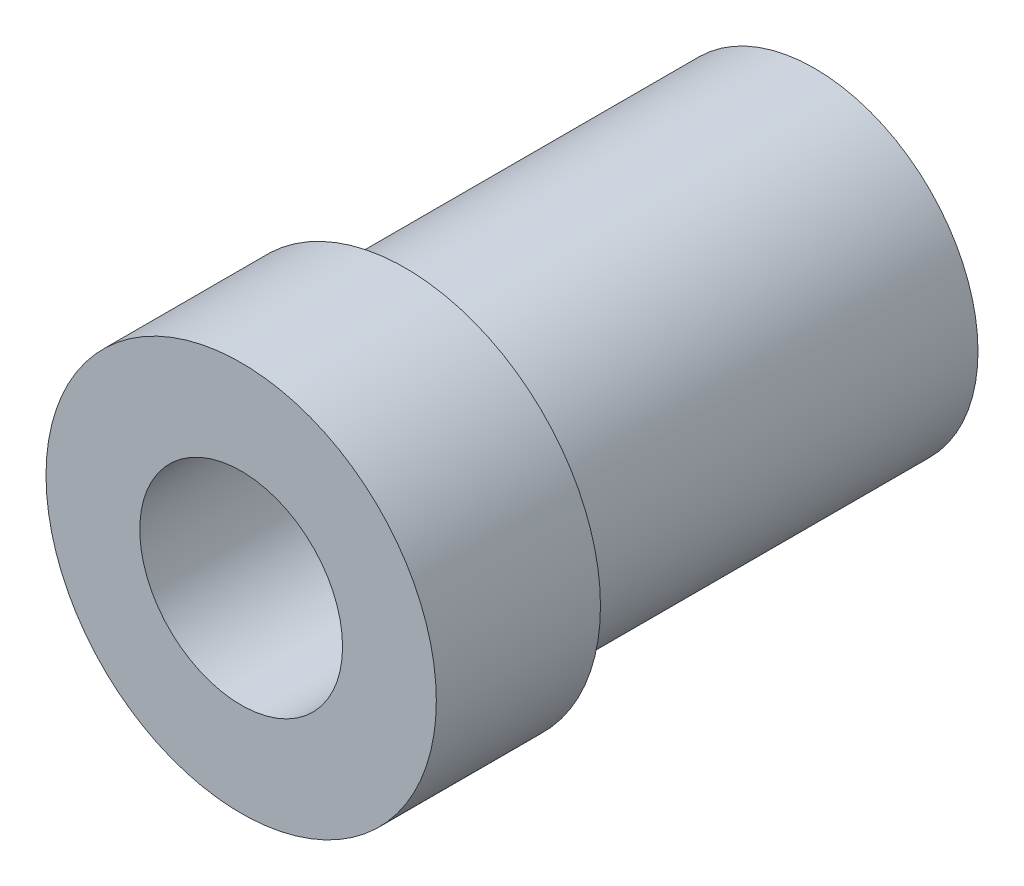
ISO-10303-21;
HEADER;
FILE_DESCRIPTION(('STEP AP214'),'2;1');
FILE_NAME('part.step','',(''),(''),'','','');
FILE_SCHEMA(('AUTOMOTIVE_DESIGN { 1 0 10303 214 1 1 1 1 }'));
ENDSEC;
DATA;
#1=APPLICATION_CONTEXT('core data for automotive mechanical design processes');
#2=APPLICATION_PROTOCOL_DEFINITION('international standard','automotive_design',2000,#1);
#3=PRODUCT_CONTEXT('',#1,'mechanical');
#4=PRODUCT('Part','Part','',(#3));
#5=PRODUCT_RELATED_PRODUCT_CATEGORY('part','',(#4));
#6=PRODUCT_DEFINITION_FORMATION('','',#4);
#7=PRODUCT_DEFINITION_CONTEXT('part definition',#1,'design');
#8=PRODUCT_DEFINITION('design','',#6,#7);
#9=PRODUCT_DEFINITION_SHAPE('','',#8);
#10=(LENGTH_UNIT() NAMED_UNIT(*) SI_UNIT(.MILLI.,.METRE.));
#11=(NAMED_UNIT(*) PLANE_ANGLE_UNIT() SI_UNIT($,.RADIAN.));
#12=(NAMED_UNIT(*) SI_UNIT($,.STERADIAN.) SOLID_ANGLE_UNIT());
#13=UNCERTAINTY_MEASURE_WITH_UNIT(LENGTH_MEASURE(1.E-05),#10,'distance_accuracy_value','');
#14=(GEOMETRIC_REPRESENTATION_CONTEXT(3) GLOBAL_UNCERTAINTY_ASSIGNED_CONTEXT((#13)) GLOBAL_UNIT_ASSIGNED_CONTEXT((#10,
#11,#12)) REPRESENTATION_CONTEXT('',''));
#15=CARTESIAN_POINT('',(0.,0.,0.));
#16=DIRECTION('',(0.,0.,1.));
#17=DIRECTION('',(1.,0.,0.));
#18=AXIS2_PLACEMENT_3D('',#15,#16,#17);
#19=CARTESIAN_POINT('',(0.,0.,0.));
#20=DIRECTION('',(0.,0.,1.));
#21=DIRECTION('',(1.,0.,0.));
#22=AXIS2_PLACEMENT_3D('',#19,#20,#21);
#23=CYLINDRICAL_SURFACE('',#22,3.9997013027737);
#24=CARTESIAN_POINT('',(0.,0.,-0.0100805876105566));
#25=DIRECTION('',(0.,0.,1.));
#26=DIRECTION('',(1.,0.,0.));
#27=AXIS2_PLACEMENT_3D('',#24,#25,#26);
#28=CIRCLE('',#27,3.9997013027737);
#29=CARTESIAN_POINT('',(3.9997013027737,0.,-0.0100805876105566));
#30=VERTEX_POINT('',#29);
#31=EDGE_CURVE('E52',#30,#30,#28,.T.);
#32=ORIENTED_EDGE('',*,*,#31,.F.);
#33=EDGE_LOOP('',(#32));
#34=FACE_BOUND('',#33,.T.);
#35=CARTESIAN_POINT('',(0.,0.,-10.0255943262682));
#36=DIRECTION('',(0.,0.,1.));
#37=DIRECTION('',(1.,0.,0.));
#38=AXIS2_PLACEMENT_3D('',#35,#36,#37);
#39=CIRCLE('',#38,3.9997013027737);
#40=CARTESIAN_POINT('',(3.9997013027737,0.,-10.0255943262682));
#41=VERTEX_POINT('',#40);
#42=EDGE_CURVE('E10',#41,#41,#39,.T.);
#43=ORIENTED_EDGE('',*,*,#42,.T.);
#44=EDGE_LOOP('',(#43));
#45=FACE_BOUND('',#44,.T.);
#46=ADVANCED_FACE('F30',(#34,#45),#23,.T.);
#47=CARTESIAN_POINT('',(0.,2.48145181579259,-10.0255943262682));
#48=DIRECTION('',(0.,0.,1.));
#49=DIRECTION('',(1.,0.,0.));
#50=AXIS2_PLACEMENT_3D('',#47,#48,#49);
#51=PLANE('',#50);
#52=ORIENTED_EDGE('',*,*,#42,.F.);
#53=EDGE_LOOP('',(#52));
#54=FACE_BOUND('',#53,.T.);
#55=CARTESIAN_POINT('',(0.,0.,-10.0255943262682));
#56=DIRECTION('',(0.,0.,1.));
#57=DIRECTION('',(1.,0.,0.));
#58=AXIS2_PLACEMENT_3D('',#55,#56,#57);
#59=CIRCLE('',#58,2.48145181579259);
#60=CARTESIAN_POINT('',(2.48145181579259,0.,-10.0255943262682));
#61=VERTEX_POINT('',#60);
#62=EDGE_CURVE('E36',#61,#61,#59,.T.);
#63=ORIENTED_EDGE('',*,*,#62,.T.);
#64=EDGE_LOOP('',(#63));
#65=FACE_BOUND('',#64,.T.);
#66=ADVANCED_FACE('F59',(#54,#65),#51,.F.);
#67=CARTESIAN_POINT('',(0.,0.,0.));
#68=DIRECTION('',(0.,0.,1.));
#69=DIRECTION('',(1.,0.,0.));
#70=AXIS2_PLACEMENT_3D('',#67,#68,#69);
#71=CYLINDRICAL_SURFACE('',#70,2.48145181579259);
#72=ORIENTED_EDGE('',*,*,#62,.F.);
#73=EDGE_LOOP('',(#72));
#74=FACE_BOUND('',#73,.T.);
#75=CARTESIAN_POINT('',(0.,0.,4.00702074742754));
#76=DIRECTION('',(0.,0.,1.));
#77=DIRECTION('',(1.,0.,0.));
#78=AXIS2_PLACEMENT_3D('',#75,#76,#77);
#79=CIRCLE('',#78,2.48145181579259);
#80=CARTESIAN_POINT('',(2.48145181579259,0.,4.00702074742754));
#81=VERTEX_POINT('',#80);
#82=EDGE_CURVE('E40',#81,#81,#79,.T.);
#83=ORIENTED_EDGE('',*,*,#82,.T.);
#84=EDGE_LOOP('',(#83));
#85=FACE_BOUND('',#84,.T.);
#86=ADVANCED_FACE('F63',(#74,#85),#71,.F.);
#87=CARTESIAN_POINT('',(0.,4.77601740680126,4.00702074742754));
#88=DIRECTION('',(0.,0.,-1.));
#89=DIRECTION('',(-1.,0.,0.));
#90=AXIS2_PLACEMENT_3D('',#87,#88,#89);
#91=PLANE('',#90);
#92=ORIENTED_EDGE('',*,*,#82,.F.);
#93=EDGE_LOOP('',(#92));
#94=FACE_BOUND('',#93,.T.);
#95=CARTESIAN_POINT('',(0.,0.,4.00702074742754));
#96=DIRECTION('',(0.,0.,1.));
#97=DIRECTION('',(1.,0.,0.));
#98=AXIS2_PLACEMENT_3D('',#95,#96,#97);
#99=CIRCLE('',#98,4.77601740680126);
#100=CARTESIAN_POINT('',(4.77601740680126,0.,4.00702074742754));
#101=VERTEX_POINT('',#100);
#102=EDGE_CURVE('E44',#101,#101,#99,.T.);
#103=ORIENTED_EDGE('',*,*,#102,.T.);
#104=EDGE_LOOP('',(#103));
#105=FACE_BOUND('',#104,.T.);
#106=ADVANCED_FACE('F68',(#94,#105),#91,.F.);
#107=CARTESIAN_POINT('',(0.,0.,0.));
#108=DIRECTION('',(0.,0.,1.));
#109=DIRECTION('',(1.,0.,0.));
#110=AXIS2_PLACEMENT_3D('',#107,#108,#109);
#111=CYLINDRICAL_SURFACE('',#110,4.77601740680126);
#112=ORIENTED_EDGE('',*,*,#102,.F.);
#113=EDGE_LOOP('',(#112));
#114=FACE_BOUND('',#113,.T.);
#115=CARTESIAN_POINT('',(0.,0.,-0.0100805876105565));
#116=DIRECTION('',(0.,0.,1.));
#117=DIRECTION('',(1.,0.,0.));
#118=AXIS2_PLACEMENT_3D('',#115,#116,#117);
#119=CIRCLE('',#118,4.77601740680126);
#120=CARTESIAN_POINT('',(4.77601740680126,0.,-0.0100805876105565));
#121=VERTEX_POINT('',#120);
#122=EDGE_CURVE('E49',#121,#121,#119,.T.);
#123=ORIENTED_EDGE('',*,*,#122,.T.);
#124=EDGE_LOOP('',(#123));
#125=FACE_BOUND('',#124,.T.);
#126=ADVANCED_FACE('F74',(#114,#125),#111,.T.);
#127=CARTESIAN_POINT('',(0.,3.9997013027737,-0.0100805876105565));
#128=DIRECTION('',(0.,0.,1.));
#129=DIRECTION('',(1.,0.,0.));
#130=AXIS2_PLACEMENT_3D('',#127,#128,#129);
#131=PLANE('',#130);
#132=ORIENTED_EDGE('',*,*,#122,.F.);
#133=EDGE_LOOP('',(#132));
#134=FACE_BOUND('',#133,.T.);
#135=ORIENTED_EDGE('',*,*,#31,.T.);
#136=EDGE_LOOP('',(#135));
#137=FACE_BOUND('',#136,.T.);
#138=ADVANCED_FACE('F56',(#134,#137),#131,.F.);
#139=CLOSED_SHELL('',(#46,#66,#86,#106,#126,#138));
#140=MANIFOLD_SOLID_BREP('B2',#139);
#141=ADVANCED_BREP_SHAPE_REPRESENTATION('',(#18,#140),#14);
#142=SHAPE_DEFINITION_REPRESENTATION(#9,#141);
ENDSEC;
END-ISO-10303-21;
